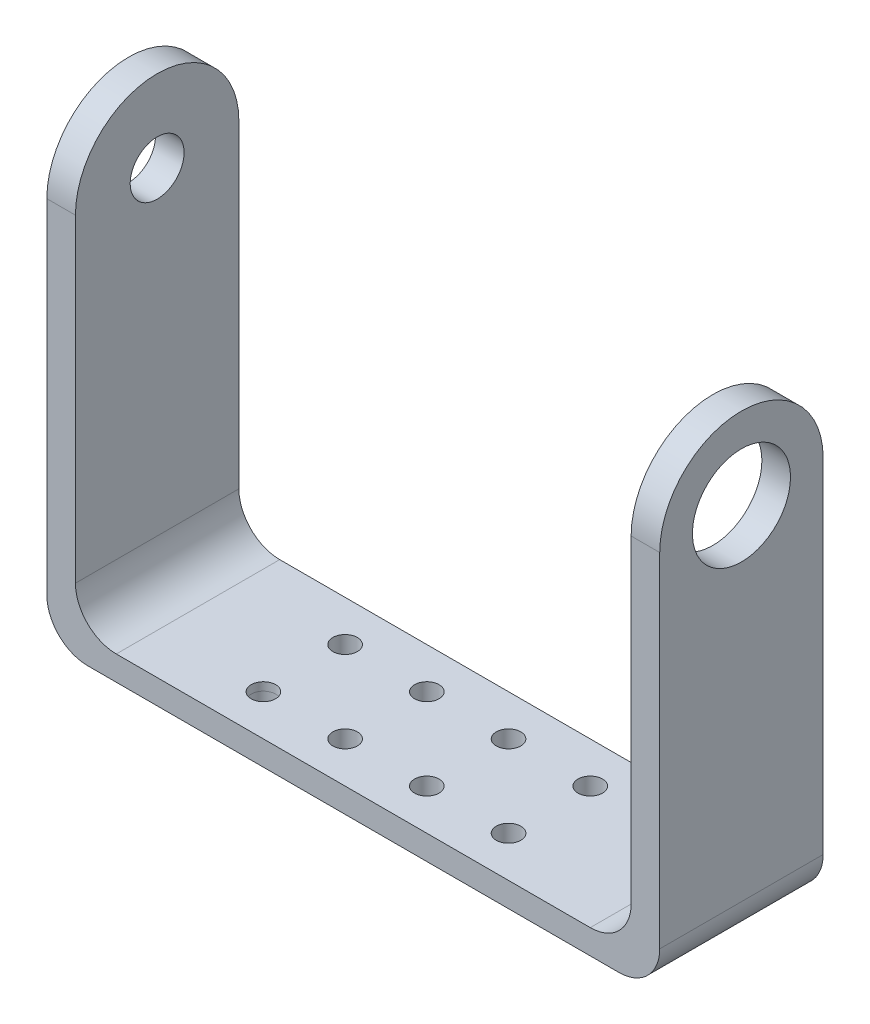
ISO-10303-21;
HEADER;
FILE_DESCRIPTION(('STEP AP214'),'2;1');
FILE_NAME('part.step','',(''),(''),'','','');
FILE_SCHEMA(('AUTOMOTIVE_DESIGN { 1 0 10303 214 1 1 1 1 }'));
ENDSEC;
DATA;
#1=APPLICATION_CONTEXT('core data for automotive mechanical design processes');
#2=APPLICATION_PROTOCOL_DEFINITION('international standard','automotive_design',2000,#1);
#3=PRODUCT_CONTEXT('',#1,'mechanical');
#4=PRODUCT('Part','Part','',(#3));
#5=PRODUCT_RELATED_PRODUCT_CATEGORY('part','',(#4));
#6=PRODUCT_DEFINITION_FORMATION('','',#4);
#7=PRODUCT_DEFINITION_CONTEXT('part definition',#1,'design');
#8=PRODUCT_DEFINITION('design','',#6,#7);
#9=PRODUCT_DEFINITION_SHAPE('','',#8);
#10=(LENGTH_UNIT() NAMED_UNIT(*) SI_UNIT(.MILLI.,.METRE.));
#11=(NAMED_UNIT(*) PLANE_ANGLE_UNIT() SI_UNIT($,.RADIAN.));
#12=(NAMED_UNIT(*) SI_UNIT($,.STERADIAN.) SOLID_ANGLE_UNIT());
#13=UNCERTAINTY_MEASURE_WITH_UNIT(LENGTH_MEASURE(1.E-05),#10,'distance_accuracy_value','');
#14=(GEOMETRIC_REPRESENTATION_CONTEXT(3) GLOBAL_UNCERTAINTY_ASSIGNED_CONTEXT((#13)) GLOBAL_UNIT_ASSIGNED_CONTEXT((#10,
#11,#12)) REPRESENTATION_CONTEXT('',''));
#15=CARTESIAN_POINT('',(0.,0.,0.));
#16=DIRECTION('',(0.,0.,1.));
#17=DIRECTION('',(1.,0.,0.));
#18=AXIS2_PLACEMENT_3D('',#15,#16,#17);
#19=CARTESIAN_POINT('',(30.,8.,-10.));
#20=DIRECTION('',(0.,0.,-1.));
#21=DIRECTION('',(-1.,0.,0.));
#22=AXIS2_PLACEMENT_3D('',#19,#20,#21);
#23=CYLINDRICAL_SURFACE('',#22,5.);
#24=DIRECTION('',(0.,0.,1.));
#25=VECTOR('',#24,1.);
#26=CARTESIAN_POINT('',(35.,8.,-10.));
#27=LINE('',#26,#25);
#28=CARTESIAN_POINT('',(35.,8.,-10.));
#29=VERTEX_POINT('',#28);
#30=CARTESIAN_POINT('',(35.,8.,10.));
#31=VERTEX_POINT('',#30);
#32=EDGE_CURVE('E273',#29,#31,#27,.T.);
#33=ORIENTED_EDGE('',*,*,#32,.F.);
#34=CARTESIAN_POINT('',(30.,8.,-10.));
#35=DIRECTION('',(0.,0.,1.));
#36=DIRECTION('',(1.,0.,0.));
#37=AXIS2_PLACEMENT_3D('',#34,#35,#36);
#38=CIRCLE('',#37,5.);
#39=CARTESIAN_POINT('',(30.,3.,-10.));
#40=VERTEX_POINT('',#39);
#41=EDGE_CURVE('E279',#29,#40,#38,.F.);
#42=ORIENTED_EDGE('',*,*,#41,.T.);
#43=DIRECTION('',(0.,0.,1.));
#44=VECTOR('',#43,1.);
#45=CARTESIAN_POINT('',(30.,3.,-10.));
#46=LINE('',#45,#44);
#47=CARTESIAN_POINT('',(30.,3.,9.99999999999999));
#48=VERTEX_POINT('',#47);
#49=EDGE_CURVE('E276',#48,#40,#46,.F.);
#50=ORIENTED_EDGE('',*,*,#49,.F.);
#51=CARTESIAN_POINT('',(30.,8.,10.));
#52=DIRECTION('',(0.,0.,-1.));
#53=DIRECTION('',(-1.,0.,0.));
#54=AXIS2_PLACEMENT_3D('',#51,#52,#53);
#55=CIRCLE('',#54,5.);
#56=EDGE_CURVE('E281',#48,#31,#55,.F.);
#57=ORIENTED_EDGE('',*,*,#56,.T.);
#58=EDGE_LOOP('',(#33,#42,#50,#57));
#59=FACE_BOUND('',#58,.T.);
#60=ADVANCED_FACE('F77',(#59),#23,.F.);
#61=CARTESIAN_POINT('',(-28.,8.,0.));
#62=DIRECTION('',(0.,0.,-1.));
#63=DIRECTION('',(-1.,0.,0.));
#64=AXIS2_PLACEMENT_3D('',#61,#62,#63);
#65=CYLINDRICAL_SURFACE('',#64,5.);
#66=DIRECTION('',(0.,0.,1.));
#67=VECTOR('',#66,1.);
#68=CARTESIAN_POINT('',(-28.,3.,0.));
#69=LINE('',#68,#67);
#70=CARTESIAN_POINT('',(-28.,3.,-10.));
#71=VERTEX_POINT('',#70);
#72=CARTESIAN_POINT('',(-28.,3.,9.99999999999999));
#73=VERTEX_POINT('',#72);
#74=EDGE_CURVE('E254',#71,#73,#69,.T.);
#75=ORIENTED_EDGE('',*,*,#74,.F.);
#76=CARTESIAN_POINT('',(-28.,8.,-10.));
#77=DIRECTION('',(0.,0.,1.));
#78=DIRECTION('',(1.,0.,0.));
#79=AXIS2_PLACEMENT_3D('',#76,#77,#78);
#80=CIRCLE('',#79,5.);
#81=CARTESIAN_POINT('',(-33.,8.,-10.));
#82=VERTEX_POINT('',#81);
#83=EDGE_CURVE('E269',#71,#82,#80,.F.);
#84=ORIENTED_EDGE('',*,*,#83,.T.);
#85=DIRECTION('',(0.,0.,1.));
#86=VECTOR('',#85,1.);
#87=CARTESIAN_POINT('',(-33.,8.,0.));
#88=LINE('',#87,#86);
#89=CARTESIAN_POINT('',(-33.,8.,10.));
#90=VERTEX_POINT('',#89);
#91=EDGE_CURVE('E266',#90,#82,#88,.F.);
#92=ORIENTED_EDGE('',*,*,#91,.F.);
#93=CARTESIAN_POINT('',(-28.,8.,10.0000000000001));
#94=DIRECTION('',(0.,0.,-1.));
#95=DIRECTION('',(-1.,0.,0.));
#96=AXIS2_PLACEMENT_3D('',#93,#94,#95);
#97=CIRCLE('',#96,5.);
#98=EDGE_CURVE('E271',#90,#73,#97,.F.);
#99=ORIENTED_EDGE('',*,*,#98,.T.);
#100=EDGE_LOOP('',(#75,#84,#92,#99));
#101=FACE_BOUND('',#100,.T.);
#102=ADVANCED_FACE('F320',(#101),#65,.F.);
#103=CARTESIAN_POINT('',(-33.,57.,-10.));
#104=DIRECTION('',(-1.,0.,0.));
#105=DIRECTION('',(0.,0.,1.));
#106=AXIS2_PLACEMENT_3D('',#103,#104,#105);
#107=PLANE('',#106);
#108=CARTESIAN_POINT('',(-33.,47.,0.));
#109=DIRECTION('',(-1.,0.,0.));
#110=DIRECTION('',(0.,0.,1.));
#111=AXIS2_PLACEMENT_3D('',#108,#109,#110);
#112=CIRCLE('',#111,3.3);
#113=CARTESIAN_POINT('',(-33.,47.,3.30000000000005));
#114=VERTEX_POINT('',#113);
#115=EDGE_CURVE('E197',#114,#114,#112,.T.);
#116=ORIENTED_EDGE('',*,*,#115,.T.);
#117=EDGE_LOOP('',(#116));
#118=FACE_BOUND('',#117,.T.);
#119=DIRECTION('',(0.,-1.,0.));
#120=VECTOR('',#119,1.);
#121=CARTESIAN_POINT('',(-33.,57.,10.));
#122=LINE('',#121,#120);
#123=CARTESIAN_POINT('',(-33.,47.,9.99999999999999));
#124=VERTEX_POINT('',#123);
#125=EDGE_CURVE('E224',#124,#90,#122,.T.);
#126=ORIENTED_EDGE('',*,*,#125,.T.);
#127=ORIENTED_EDGE('',*,*,#91,.T.);
#128=DIRECTION('',(0.,-1.,0.));
#129=VECTOR('',#128,1.);
#130=CARTESIAN_POINT('',(-33.,57.,-10.));
#131=LINE('',#130,#129);
#132=CARTESIAN_POINT('',(-33.,47.,-10.));
#133=VERTEX_POINT('',#132);
#134=EDGE_CURVE('E219',#133,#82,#131,.T.);
#135=ORIENTED_EDGE('',*,*,#134,.F.);
#136=CARTESIAN_POINT('',(-33.,47.,0.));
#137=DIRECTION('',(-1.,0.,0.));
#138=DIRECTION('',(0.,0.,1.));
#139=AXIS2_PLACEMENT_3D('',#136,#137,#138);
#140=CIRCLE('',#139,10.);
#141=EDGE_CURVE('E184',#124,#133,#140,.T.);
#142=ORIENTED_EDGE('',*,*,#141,.F.);
#143=EDGE_LOOP('',(#126,#127,#135,#142));
#144=FACE_BOUND('',#143,.T.);
#145=ADVANCED_FACE('F314',(#118,#144),#107,.F.);
#146=CARTESIAN_POINT('',(35.,57.,-10.));
#147=DIRECTION('',(1.,0.,0.));
#148=DIRECTION('',(0.,0.,-1.));
#149=AXIS2_PLACEMENT_3D('',#146,#147,#148);
#150=PLANE('',#149);
#151=CARTESIAN_POINT('',(35.,47.,0.));
#152=DIRECTION('',(1.,0.,0.));
#153=DIRECTION('',(0.,0.,-1.));
#154=AXIS2_PLACEMENT_3D('',#151,#152,#153);
#155=CIRCLE('',#154,6.);
#156=CARTESIAN_POINT('',(35.,47.,-6.00000000000001));
#157=VERTEX_POINT('',#156);
#158=EDGE_CURVE('E203',#157,#157,#155,.T.);
#159=ORIENTED_EDGE('',*,*,#158,.T.);
#160=EDGE_LOOP('',(#159));
#161=FACE_BOUND('',#160,.T.);
#162=DIRECTION('',(0.,-1.,0.));
#163=VECTOR('',#162,1.);
#164=CARTESIAN_POINT('',(35.,57.,-10.));
#165=LINE('',#164,#163);
#166=CARTESIAN_POINT('',(35.,47.,-10.));
#167=VERTEX_POINT('',#166);
#168=EDGE_CURVE('E216',#167,#29,#165,.T.);
#169=ORIENTED_EDGE('',*,*,#168,.T.);
#170=ORIENTED_EDGE('',*,*,#32,.T.);
#171=DIRECTION('',(0.,-1.,0.));
#172=VECTOR('',#171,1.);
#173=CARTESIAN_POINT('',(35.,57.,10.));
#174=LINE('',#173,#172);
#175=CARTESIAN_POINT('',(35.,47.,9.99999999999999));
#176=VERTEX_POINT('',#175);
#177=EDGE_CURVE('E213',#176,#31,#174,.T.);
#178=ORIENTED_EDGE('',*,*,#177,.F.);
#179=CARTESIAN_POINT('',(35.,47.,0.));
#180=DIRECTION('',(1.,0.,0.));
#181=DIRECTION('',(0.,0.,-1.));
#182=AXIS2_PLACEMENT_3D('',#179,#180,#181);
#183=CIRCLE('',#182,10.);
#184=EDGE_CURVE('E185',#167,#176,#183,.T.);
#185=ORIENTED_EDGE('',*,*,#184,.F.);
#186=EDGE_LOOP('',(#169,#170,#178,#185));
#187=FACE_BOUND('',#186,.T.);
#188=ADVANCED_FACE('F456',(#161,#187),#150,.F.);
#189=CARTESIAN_POINT('',(38.5,2.,-10.));
#190=DIRECTION('',(-1.,0.,0.));
#191=DIRECTION('',(0.,0.,1.));
#192=AXIS2_PLACEMENT_3D('',#189,#190,#191);
#193=PLANE('',#192);
#194=CARTESIAN_POINT('',(38.5,47.,0.));
#195=DIRECTION('',(1.,0.,0.));
#196=DIRECTION('',(0.,0.,-1.));
#197=AXIS2_PLACEMENT_3D('',#194,#195,#196);
#198=CIRCLE('',#197,6.);
#199=CARTESIAN_POINT('',(38.5,47.,-6.00000000000001));
#200=VERTEX_POINT('',#199);
#201=EDGE_CURVE('E200',#200,#200,#198,.T.);
#202=ORIENTED_EDGE('',*,*,#201,.F.);
#203=EDGE_LOOP('',(#202));
#204=FACE_BOUND('',#203,.T.);
#205=DIRECTION('',(0.,-1.,0.));
#206=VECTOR('',#205,1.);
#207=CARTESIAN_POINT('',(38.5,2.,9.99999999999999));
#208=LINE('',#207,#206);
#209=CARTESIAN_POINT('',(38.5,47.,9.99999999999999));
#210=VERTEX_POINT('',#209);
#211=CARTESIAN_POINT('',(38.5,5.,9.99999999999999));
#212=VERTEX_POINT('',#211);
#213=EDGE_CURVE('E251',#210,#212,#208,.T.);
#214=ORIENTED_EDGE('',*,*,#213,.T.);
#215=DIRECTION('',(0.,0.,-1.));
#216=VECTOR('',#215,1.);
#217=CARTESIAN_POINT('',(38.5,5.,-10.));
#218=LINE('',#217,#216);
#219=CARTESIAN_POINT('',(38.5,5.,-10.));
#220=VERTEX_POINT('',#219);
#221=EDGE_CURVE('E283',#212,#220,#218,.T.);
#222=ORIENTED_EDGE('',*,*,#221,.T.);
#223=DIRECTION('',(0.,-1.,0.));
#224=VECTOR('',#223,1.);
#225=CARTESIAN_POINT('',(38.5,2.,-10.));
#226=LINE('',#225,#224);
#227=CARTESIAN_POINT('',(38.5,47.,-10.));
#228=VERTEX_POINT('',#227);
#229=EDGE_CURVE('E249',#228,#220,#226,.T.);
#230=ORIENTED_EDGE('',*,*,#229,.F.);
#231=CARTESIAN_POINT('',(38.5,47.,0.));
#232=DIRECTION('',(1.,0.,0.));
#233=DIRECTION('',(0.,0.,-1.));
#234=AXIS2_PLACEMENT_3D('',#231,#232,#233);
#235=CIRCLE('',#234,10.);
#236=EDGE_CURVE('E208',#228,#210,#235,.T.);
#237=ORIENTED_EDGE('',*,*,#236,.T.);
#238=EDGE_LOOP('',(#214,#222,#230,#237));
#239=FACE_BOUND('',#238,.T.);
#240=ADVANCED_FACE('F302',(#204,#239),#193,.F.);
#241=CARTESIAN_POINT('',(35.,2.,10.));
#242=DIRECTION('',(0.,0.,-1.));
#243=DIRECTION('',(-1.,0.,0.));
#244=AXIS2_PLACEMENT_3D('',#241,#242,#243);
#245=PLANE('',#244);
#246=DIRECTION('',(1.,0.,0.));
#247=VECTOR('',#246,1.);
#248=CARTESIAN_POINT('',(35.,0.,10.));
#249=LINE('',#248,#247);
#250=CARTESIAN_POINT('',(-31.5,0.,10.0000000000001));
#251=VERTEX_POINT('',#250);
#252=CARTESIAN_POINT('',(33.5,0.,10.));
#253=VERTEX_POINT('',#252);
#254=EDGE_CURVE('E245',#251,#253,#249,.T.);
#255=ORIENTED_EDGE('',*,*,#254,.T.);
#256=CARTESIAN_POINT('',(33.5,5.,10.));
#257=DIRECTION('',(0.,0.,-1.));
#258=DIRECTION('',(-1.,0.,0.));
#259=AXIS2_PLACEMENT_3D('',#256,#257,#258);
#260=CIRCLE('',#259,5.);
#261=EDGE_CURVE('E85',#253,#212,#260,.F.);
#262=ORIENTED_EDGE('',*,*,#261,.T.);
#263=ORIENTED_EDGE('',*,*,#213,.F.);
#264=DIRECTION('',(1.,0.,0.));
#265=VECTOR('',#264,1.);
#266=CARTESIAN_POINT('',(-48.5,47.,9.99999999999999));
#267=LINE('',#266,#265);
#268=EDGE_CURVE('E204',#176,#210,#267,.T.);
#269=ORIENTED_EDGE('',*,*,#268,.F.);
#270=ORIENTED_EDGE('',*,*,#177,.T.);
#271=ORIENTED_EDGE('',*,*,#56,.F.);
#272=DIRECTION('',(1.,0.,0.));
#273=VECTOR('',#272,1.);
#274=CARTESIAN_POINT('',(-33.,3.,9.99999999999999));
#275=LINE('',#274,#273);
#276=EDGE_CURVE('E325',#73,#48,#275,.T.);
#277=ORIENTED_EDGE('',*,*,#276,.F.);
#278=ORIENTED_EDGE('',*,*,#98,.F.);
#279=ORIENTED_EDGE('',*,*,#125,.F.);
#280=CARTESIAN_POINT('',(-36.5,47.,9.99999999999999));
#281=VERTEX_POINT('',#280);
#282=EDGE_CURVE('E207',#281,#124,#267,.T.);
#283=ORIENTED_EDGE('',*,*,#282,.F.);
#284=DIRECTION('',(0.,-1.,0.));
#285=VECTOR('',#284,1.);
#286=CARTESIAN_POINT('',(-36.5,0.,10.));
#287=LINE('',#286,#285);
#288=CARTESIAN_POINT('',(-36.5,5.,10.));
#289=VERTEX_POINT('',#288);
#290=EDGE_CURVE('E177',#281,#289,#287,.T.);
#291=ORIENTED_EDGE('',*,*,#290,.T.);
#292=CARTESIAN_POINT('',(-31.5,5.,10.0000000000001));
#293=DIRECTION('',(0.,0.,-1.));
#294=DIRECTION('',(-1.,0.,0.));
#295=AXIS2_PLACEMENT_3D('',#292,#293,#294);
#296=CIRCLE('',#295,5.);
#297=EDGE_CURVE('E293',#289,#251,#296,.F.);
#298=ORIENTED_EDGE('',*,*,#297,.T.);
#299=EDGE_LOOP('',(#255,#262,#263,#269,#270,#271,#277,#278,#279,#283,#291,#298));
#300=FACE_BOUND('',#299,.T.);
#301=ADVANCED_FACE('F297',(#300),#245,.F.);
#302=CARTESIAN_POINT('',(0.,0.,0.));
#303=DIRECTION('',(0.,1.,0.));
#304=DIRECTION('',(0.,0.,1.));
#305=AXIS2_PLACEMENT_3D('',#302,#303,#304);
#306=PLANE('',#305);
#307=DIRECTION('',(-1.,0.,0.));
#308=VECTOR('',#307,1.);
#309=CARTESIAN_POINT('',(35.,0.,-10.));
#310=LINE('',#309,#308);
#311=CARTESIAN_POINT('',(33.5,0.,-10.));
#312=VERTEX_POINT('',#311);
#313=CARTESIAN_POINT('',(-31.5,0.,-10.));
#314=VERTEX_POINT('',#313);
#315=EDGE_CURVE('E247',#312,#314,#310,.T.);
#316=ORIENTED_EDGE('',*,*,#315,.F.);
#317=DIRECTION('',(0.,0.,-1.));
#318=VECTOR('',#317,1.);
#319=CARTESIAN_POINT('',(33.5,0.,0.));
#320=LINE('',#319,#318);
#321=EDGE_CURVE('E98',#312,#253,#320,.F.);
#322=ORIENTED_EDGE('',*,*,#321,.T.);
#323=ORIENTED_EDGE('',*,*,#254,.F.);
#324=DIRECTION('',(0.,0.,-1.));
#325=VECTOR('',#324,1.);
#326=CARTESIAN_POINT('',(-31.5,0.,-10.));
#327=LINE('',#326,#325);
#328=EDGE_CURVE('E289',#251,#314,#327,.T.);
#329=ORIENTED_EDGE('',*,*,#328,.T.);
#330=EDGE_LOOP('',(#316,#322,#323,#329));
#331=FACE_BOUND('',#330,.T.);
#332=CARTESIAN_POINT('',(-15.,0.,-5.));
#333=DIRECTION('',(0.,1.,0.));
#334=DIRECTION('',(0.,0.,1.));
#335=AXIS2_PLACEMENT_3D('',#332,#333,#334);
#336=CIRCLE('',#335,1.5);
#337=CARTESIAN_POINT('',(-15.,0.,-3.5));
#338=VERTEX_POINT('',#337);
#339=EDGE_CURVE('E242',#338,#338,#336,.T.);
#340=ORIENTED_EDGE('',*,*,#339,.T.);
#341=EDGE_LOOP('',(#340));
#342=FACE_BOUND('',#341,.T.);
#343=CARTESIAN_POINT('',(-5.,0.,-5.));
#344=DIRECTION('',(0.,1.,0.));
#345=DIRECTION('',(0.,0.,1.));
#346=AXIS2_PLACEMENT_3D('',#343,#344,#345);
#347=CIRCLE('',#346,1.5);
#348=CARTESIAN_POINT('',(-5.,0.,-3.5));
#349=VERTEX_POINT('',#348);
#350=EDGE_CURVE('E239',#349,#349,#347,.T.);
#351=ORIENTED_EDGE('',*,*,#350,.T.);
#352=EDGE_LOOP('',(#351));
#353=FACE_BOUND('',#352,.T.);
#354=CARTESIAN_POINT('',(-15.,0.,5.));
#355=DIRECTION('',(0.,1.,0.));
#356=DIRECTION('',(0.,0.,1.));
#357=AXIS2_PLACEMENT_3D('',#354,#355,#356);
#358=CIRCLE('',#357,1.5);
#359=CARTESIAN_POINT('',(-15.,0.,6.5));
#360=VERTEX_POINT('',#359);
#361=EDGE_CURVE('E236',#360,#360,#358,.T.);
#362=ORIENTED_EDGE('',*,*,#361,.T.);
#363=EDGE_LOOP('',(#362));
#364=FACE_BOUND('',#363,.T.);
#365=CARTESIAN_POINT('',(-5.,0.,5.));
#366=DIRECTION('',(0.,1.,0.));
#367=DIRECTION('',(0.,0.,1.));
#368=AXIS2_PLACEMENT_3D('',#365,#366,#367);
#369=CIRCLE('',#368,1.5);
#370=CARTESIAN_POINT('',(-5.,0.,6.5));
#371=VERTEX_POINT('',#370);
#372=EDGE_CURVE('E233',#371,#371,#369,.T.);
#373=ORIENTED_EDGE('',*,*,#372,.T.);
#374=EDGE_LOOP('',(#373));
#375=FACE_BOUND('',#374,.T.);
#376=CARTESIAN_POINT('',(15.,0.,5.));
#377=DIRECTION('',(0.,1.,0.));
#378=DIRECTION('',(0.,0.,-1.));
#379=AXIS2_PLACEMENT_3D('',#376,#377,#378);
#380=CIRCLE('',#379,1.5);
#381=CARTESIAN_POINT('',(15.,0.,3.5));
#382=VERTEX_POINT('',#381);
#383=EDGE_CURVE('E230',#382,#382,#380,.T.);
#384=ORIENTED_EDGE('',*,*,#383,.T.);
#385=EDGE_LOOP('',(#384));
#386=FACE_BOUND('',#385,.T.);
#387=CARTESIAN_POINT('',(5.,0.,5.));
#388=DIRECTION('',(0.,1.,0.));
#389=DIRECTION('',(0.,0.,-1.));
#390=AXIS2_PLACEMENT_3D('',#387,#388,#389);
#391=CIRCLE('',#390,1.5);
#392=CARTESIAN_POINT('',(5.,0.,3.5));
#393=VERTEX_POINT('',#392);
#394=EDGE_CURVE('E227',#393,#393,#391,.T.);
#395=ORIENTED_EDGE('',*,*,#394,.T.);
#396=EDGE_LOOP('',(#395));
#397=FACE_BOUND('',#396,.T.);
#398=CARTESIAN_POINT('',(5.,0.,-5.));
#399=DIRECTION('',(0.,1.,0.));
#400=DIRECTION('',(0.,0.,-1.));
#401=AXIS2_PLACEMENT_3D('',#398,#399,#400);
#402=CIRCLE('',#401,1.5);
#403=CARTESIAN_POINT('',(5.,0.,-6.5));
#404=VERTEX_POINT('',#403);
#405=EDGE_CURVE('E223',#404,#404,#402,.T.);
#406=ORIENTED_EDGE('',*,*,#405,.T.);
#407=EDGE_LOOP('',(#406));
#408=FACE_BOUND('',#407,.T.);
#409=CARTESIAN_POINT('',(15.,0.,-5.));
#410=DIRECTION('',(0.,1.,0.));
#411=DIRECTION('',(0.,0.,-1.));
#412=AXIS2_PLACEMENT_3D('',#409,#410,#411);
#413=CIRCLE('',#412,1.5);
#414=CARTESIAN_POINT('',(15.,0.,-6.5));
#415=VERTEX_POINT('',#414);
#416=EDGE_CURVE('E220',#415,#415,#413,.T.);
#417=ORIENTED_EDGE('',*,*,#416,.T.);
#418=EDGE_LOOP('',(#417));
#419=FACE_BOUND('',#418,.T.);
#420=ADVANCED_FACE('F305',(#331,#342,#353,#364,#375,#386,#397,#408,#419),#306,.F.);
#421=CARTESIAN_POINT('',(35.,2.,-10.));
#422=DIRECTION('',(0.,0.,1.));
#423=DIRECTION('',(1.,0.,0.));
#424=AXIS2_PLACEMENT_3D('',#421,#422,#423);
#425=PLANE('',#424);
#426=ORIENTED_EDGE('',*,*,#229,.T.);
#427=CARTESIAN_POINT('',(33.5,5.,-10.));
#428=DIRECTION('',(0.,0.,1.));
#429=DIRECTION('',(1.,0.,0.));
#430=AXIS2_PLACEMENT_3D('',#427,#428,#429);
#431=CIRCLE('',#430,5.);
#432=EDGE_CURVE('E287',#220,#312,#431,.F.);
#433=ORIENTED_EDGE('',*,*,#432,.T.);
#434=ORIENTED_EDGE('',*,*,#315,.T.);
#435=CARTESIAN_POINT('',(-31.5,5.,-10.));
#436=DIRECTION('',(0.,0.,1.));
#437=DIRECTION('',(1.,0.,0.));
#438=AXIS2_PLACEMENT_3D('',#435,#436,#437);
#439=CIRCLE('',#438,5.);
#440=CARTESIAN_POINT('',(-36.5,5.,-10.));
#441=VERTEX_POINT('',#440);
#442=EDGE_CURVE('E175',#314,#441,#439,.F.);
#443=ORIENTED_EDGE('',*,*,#442,.T.);
#444=DIRECTION('',(0.,1.,0.));
#445=VECTOR('',#444,1.);
#446=CARTESIAN_POINT('',(-36.5,0.,-10.));
#447=LINE('',#446,#445);
#448=CARTESIAN_POINT('',(-36.5,47.,-10.));
#449=VERTEX_POINT('',#448);
#450=EDGE_CURVE('E167',#441,#449,#447,.T.);
#451=ORIENTED_EDGE('',*,*,#450,.T.);
#452=DIRECTION('',(1.,0.,0.));
#453=VECTOR('',#452,1.);
#454=CARTESIAN_POINT('',(-48.5,47.,-10.));
#455=LINE('',#454,#453);
#456=EDGE_CURVE('E172',#449,#133,#455,.T.);
#457=ORIENTED_EDGE('',*,*,#456,.T.);
#458=ORIENTED_EDGE('',*,*,#134,.T.);
#459=ORIENTED_EDGE('',*,*,#83,.F.);
#460=DIRECTION('',(-1.,0.,0.));
#461=VECTOR('',#460,1.);
#462=CARTESIAN_POINT('',(-33.,3.,-10.));
#463=LINE('',#462,#461);
#464=EDGE_CURVE('E318',#40,#71,#463,.T.);
#465=ORIENTED_EDGE('',*,*,#464,.F.);
#466=ORIENTED_EDGE('',*,*,#41,.F.);
#467=ORIENTED_EDGE('',*,*,#168,.F.);
#468=EDGE_CURVE('E186',#167,#228,#455,.T.);
#469=ORIENTED_EDGE('',*,*,#468,.T.);
#470=EDGE_LOOP('',(#426,#433,#434,#443,#451,#457,#458,#459,#465,#466,#467,#469));
#471=FACE_BOUND('',#470,.T.);
#472=ADVANCED_FACE('F170',(#471),#425,.F.);
#473=CARTESIAN_POINT('',(-15.,2.,-5.));
#474=DIRECTION('',(0.,-1.,0.));
#475=DIRECTION('',(0.,0.,-1.));
#476=AXIS2_PLACEMENT_3D('',#473,#474,#475);
#477=CYLINDRICAL_SURFACE('',#476,1.5);
#478=ORIENTED_EDGE('',*,*,#339,.F.);
#479=EDGE_LOOP('',(#478));
#480=FACE_BOUND('',#479,.T.);
#481=CARTESIAN_POINT('',(-15.,3.,-5.));
#482=DIRECTION('',(0.,1.,0.));
#483=DIRECTION('',(0.,0.,1.));
#484=AXIS2_PLACEMENT_3D('',#481,#482,#483);
#485=CIRCLE('',#484,1.5);
#486=CARTESIAN_POINT('',(-15.,3.,-3.5));
#487=VERTEX_POINT('',#486);
#488=EDGE_CURVE('E327',#487,#487,#485,.T.);
#489=ORIENTED_EDGE('',*,*,#488,.T.);
#490=EDGE_LOOP('',(#489));
#491=FACE_BOUND('',#490,.T.);
#492=ADVANCED_FACE('F496',(#480,#491),#477,.F.);
#493=CARTESIAN_POINT('',(-5.,2.,-5.));
#494=DIRECTION('',(0.,-1.,0.));
#495=DIRECTION('',(0.,0.,-1.));
#496=AXIS2_PLACEMENT_3D('',#493,#494,#495);
#497=CYLINDRICAL_SURFACE('',#496,1.5);
#498=ORIENTED_EDGE('',*,*,#350,.F.);
#499=EDGE_LOOP('',(#498));
#500=FACE_BOUND('',#499,.T.);
#501=CARTESIAN_POINT('',(-5.,3.,-5.));
#502=DIRECTION('',(0.,1.,0.));
#503=DIRECTION('',(0.,0.,1.));
#504=AXIS2_PLACEMENT_3D('',#501,#502,#503);
#505=CIRCLE('',#504,1.5);
#506=CARTESIAN_POINT('',(-5.,3.,-3.5));
#507=VERTEX_POINT('',#506);
#508=EDGE_CURVE('E331',#507,#507,#505,.T.);
#509=ORIENTED_EDGE('',*,*,#508,.T.);
#510=EDGE_LOOP('',(#509));
#511=FACE_BOUND('',#510,.T.);
#512=ADVANCED_FACE('F344',(#500,#511),#497,.F.);
#513=CARTESIAN_POINT('',(-15.,2.,5.));
#514=DIRECTION('',(0.,-1.,0.));
#515=DIRECTION('',(0.,0.,-1.));
#516=AXIS2_PLACEMENT_3D('',#513,#514,#515);
#517=CYLINDRICAL_SURFACE('',#516,1.5);
#518=CARTESIAN_POINT('',(-15.,2.,5.));
#519=DIRECTION('',(0.,-1.,0.));
#520=DIRECTION('',(0.,0.,-1.));
#521=AXIS2_PLACEMENT_3D('',#518,#519,#520);
#522=CIRCLE('',#521,1.5);
#523=CARTESIAN_POINT('',(-15.,2.,3.50000000000001));
#524=VERTEX_POINT('',#523);
#525=EDGE_CURVE('E192',#524,#524,#522,.T.);
#526=ORIENTED_EDGE('',*,*,#525,.F.);
#527=EDGE_LOOP('',(#526));
#528=FACE_BOUND('',#527,.T.);
#529=ORIENTED_EDGE('',*,*,#361,.F.);
#530=EDGE_LOOP('',(#529));
#531=FACE_BOUND('',#530,.T.);
#532=ADVANCED_FACE('F340',(#528,#531),#517,.F.);
#533=CARTESIAN_POINT('',(-5.,2.,5.));
#534=DIRECTION('',(0.,-1.,0.));
#535=DIRECTION('',(0.,0.,-1.));
#536=AXIS2_PLACEMENT_3D('',#533,#534,#535);
#537=CYLINDRICAL_SURFACE('',#536,1.5);
#538=ORIENTED_EDGE('',*,*,#372,.F.);
#539=EDGE_LOOP('',(#538));
#540=FACE_BOUND('',#539,.T.);
#541=CARTESIAN_POINT('',(-5.,3.,5.));
#542=DIRECTION('',(0.,1.,0.));
#543=DIRECTION('',(0.,0.,1.));
#544=AXIS2_PLACEMENT_3D('',#541,#542,#543);
#545=CIRCLE('',#544,1.5);
#546=CARTESIAN_POINT('',(-5.,3.,6.5));
#547=VERTEX_POINT('',#546);
#548=EDGE_CURVE('E397',#547,#547,#545,.T.);
#549=ORIENTED_EDGE('',*,*,#548,.T.);
#550=EDGE_LOOP('',(#549));
#551=FACE_BOUND('',#550,.T.);
#552=ADVANCED_FACE('F343',(#540,#551),#537,.F.);
#553=CARTESIAN_POINT('',(15.,2.,5.));
#554=DIRECTION('',(0.,-1.,0.));
#555=DIRECTION('',(0.,0.,-1.));
#556=AXIS2_PLACEMENT_3D('',#553,#554,#555);
#557=CYLINDRICAL_SURFACE('',#556,1.5);
#558=ORIENTED_EDGE('',*,*,#383,.F.);
#559=EDGE_LOOP('',(#558));
#560=FACE_BOUND('',#559,.T.);
#561=CARTESIAN_POINT('',(15.,3.,5.));
#562=DIRECTION('',(0.,1.,0.));
#563=DIRECTION('',(0.,0.,1.));
#564=AXIS2_PLACEMENT_3D('',#561,#562,#563);
#565=CIRCLE('',#564,1.5);
#566=CARTESIAN_POINT('',(15.,3.,6.5));
#567=VERTEX_POINT('',#566);
#568=EDGE_CURVE('E372',#567,#567,#565,.T.);
#569=ORIENTED_EDGE('',*,*,#568,.T.);
#570=EDGE_LOOP('',(#569));
#571=FACE_BOUND('',#570,.T.);
#572=ADVANCED_FACE('F410',(#560,#571),#557,.F.);
#573=CARTESIAN_POINT('',(5.,2.,5.));
#574=DIRECTION('',(0.,-1.,0.));
#575=DIRECTION('',(0.,0.,-1.));
#576=AXIS2_PLACEMENT_3D('',#573,#574,#575);
#577=CYLINDRICAL_SURFACE('',#576,1.5);
#578=ORIENTED_EDGE('',*,*,#394,.F.);
#579=EDGE_LOOP('',(#578));
#580=FACE_BOUND('',#579,.T.);
#581=CARTESIAN_POINT('',(5.,3.,5.));
#582=DIRECTION('',(0.,1.,0.));
#583=DIRECTION('',(0.,0.,1.));
#584=AXIS2_PLACEMENT_3D('',#581,#582,#583);
#585=CIRCLE('',#584,1.5);
#586=CARTESIAN_POINT('',(5.,3.,6.5));
#587=VERTEX_POINT('',#586);
#588=EDGE_CURVE('E377',#587,#587,#585,.T.);
#589=ORIENTED_EDGE('',*,*,#588,.T.);
#590=EDGE_LOOP('',(#589));
#591=FACE_BOUND('',#590,.T.);
#592=ADVANCED_FACE('F408',(#580,#591),#577,.F.);
#593=CARTESIAN_POINT('',(5.,2.,-5.));
#594=DIRECTION('',(0.,-1.,0.));
#595=DIRECTION('',(0.,0.,-1.));
#596=AXIS2_PLACEMENT_3D('',#593,#594,#595);
#597=CYLINDRICAL_SURFACE('',#596,1.5);
#598=ORIENTED_EDGE('',*,*,#405,.F.);
#599=EDGE_LOOP('',(#598));
#600=FACE_BOUND('',#599,.T.);
#601=CARTESIAN_POINT('',(5.,3.,-5.));
#602=DIRECTION('',(0.,1.,0.));
#603=DIRECTION('',(0.,0.,1.));
#604=AXIS2_PLACEMENT_3D('',#601,#602,#603);
#605=CIRCLE('',#604,1.5);
#606=CARTESIAN_POINT('',(5.,3.,-3.5));
#607=VERTEX_POINT('',#606);
#608=EDGE_CURVE('E371',#607,#607,#605,.T.);
#609=ORIENTED_EDGE('',*,*,#608,.T.);
#610=EDGE_LOOP('',(#609));
#611=FACE_BOUND('',#610,.T.);
#612=ADVANCED_FACE('F365',(#600,#611),#597,.F.);
#613=CARTESIAN_POINT('',(15.,2.,-5.));
#614=DIRECTION('',(0.,-1.,0.));
#615=DIRECTION('',(0.,0.,-1.));
#616=AXIS2_PLACEMENT_3D('',#613,#614,#615);
#617=CYLINDRICAL_SURFACE('',#616,1.5);
#618=ORIENTED_EDGE('',*,*,#416,.F.);
#619=EDGE_LOOP('',(#618));
#620=FACE_BOUND('',#619,.T.);
#621=CARTESIAN_POINT('',(15.,3.,-5.));
#622=DIRECTION('',(0.,1.,0.));
#623=DIRECTION('',(0.,0.,1.));
#624=AXIS2_PLACEMENT_3D('',#621,#622,#623);
#625=CIRCLE('',#624,1.5);
#626=CARTESIAN_POINT('',(15.,3.,-3.5));
#627=VERTEX_POINT('',#626);
#628=EDGE_CURVE('E369',#627,#627,#625,.T.);
#629=ORIENTED_EDGE('',*,*,#628,.T.);
#630=EDGE_LOOP('',(#629));
#631=FACE_BOUND('',#630,.T.);
#632=ADVANCED_FACE('F361',(#620,#631),#617,.F.);
#633=CARTESIAN_POINT('',(-48.5,47.,0.));
#634=DIRECTION('',(1.,0.,0.));
#635=DIRECTION('',(0.,0.,-1.));
#636=AXIS2_PLACEMENT_3D('',#633,#634,#635);
#637=CYLINDRICAL_SURFACE('',#636,10.);
#638=ORIENTED_EDGE('',*,*,#184,.T.);
#639=ORIENTED_EDGE('',*,*,#268,.T.);
#640=ORIENTED_EDGE('',*,*,#236,.F.);
#641=ORIENTED_EDGE('',*,*,#468,.F.);
#642=EDGE_LOOP('',(#638,#639,#640,#641));
#643=FACE_BOUND('',#642,.T.);
#644=ADVANCED_FACE('F364',(#643),#637,.T.);
#645=ORIENTED_EDGE('',*,*,#456,.F.);
#646=CARTESIAN_POINT('',(-36.5,47.,0.));
#647=DIRECTION('',(-1.,0.,0.));
#648=DIRECTION('',(0.,0.,1.));
#649=AXIS2_PLACEMENT_3D('',#646,#647,#648);
#650=CIRCLE('',#649,10.);
#651=EDGE_CURVE('E178',#449,#281,#650,.F.);
#652=ORIENTED_EDGE('',*,*,#651,.T.);
#653=ORIENTED_EDGE('',*,*,#282,.T.);
#654=ORIENTED_EDGE('',*,*,#141,.T.);
#655=EDGE_LOOP('',(#645,#652,#653,#654));
#656=FACE_BOUND('',#655,.T.);
#657=ADVANCED_FACE('F182',(#656),#637,.T.);
#658=CARTESIAN_POINT('',(-48.5,47.,0.));
#659=DIRECTION('',(1.,0.,0.));
#660=DIRECTION('',(0.,0.,-1.));
#661=AXIS2_PLACEMENT_3D('',#658,#659,#660);
#662=CYLINDRICAL_SURFACE('',#661,6.);
#663=ORIENTED_EDGE('',*,*,#201,.T.);
#664=EDGE_LOOP('',(#663));
#665=FACE_BOUND('',#664,.T.);
#666=ORIENTED_EDGE('',*,*,#158,.F.);
#667=EDGE_LOOP('',(#666));
#668=FACE_BOUND('',#667,.T.);
#669=ADVANCED_FACE('F449',(#665,#668),#662,.F.);
#670=CARTESIAN_POINT('',(-33.,47.,0.));
#671=DIRECTION('',(-1.,0.,0.));
#672=DIRECTION('',(0.,0.,1.));
#673=AXIS2_PLACEMENT_3D('',#670,#671,#672);
#674=CYLINDRICAL_SURFACE('',#673,3.3);
#675=ORIENTED_EDGE('',*,*,#115,.F.);
#676=EDGE_LOOP('',(#675));
#677=FACE_BOUND('',#676,.T.);
#678=CARTESIAN_POINT('',(-36.5,47.,0.));
#679=DIRECTION('',(-1.,0.,0.));
#680=DIRECTION('',(0.,0.,1.));
#681=AXIS2_PLACEMENT_3D('',#678,#679,#680);
#682=CIRCLE('',#681,3.3);
#683=CARTESIAN_POINT('',(-36.5,47.,3.30000000000005));
#684=VERTEX_POINT('',#683);
#685=EDGE_CURVE('E189',#684,#684,#682,.T.);
#686=ORIENTED_EDGE('',*,*,#685,.T.);
#687=EDGE_LOOP('',(#686));
#688=FACE_BOUND('',#687,.T.);
#689=ADVANCED_FACE('F445',(#677,#688),#674,.F.);
#690=CARTESIAN_POINT('',(-36.5,0.,0.));
#691=DIRECTION('',(-1.,0.,0.));
#692=DIRECTION('',(0.,0.,1.));
#693=AXIS2_PLACEMENT_3D('',#690,#691,#692);
#694=PLANE('',#693);
#695=ORIENTED_EDGE('',*,*,#685,.F.);
#696=EDGE_LOOP('',(#695));
#697=FACE_BOUND('',#696,.T.);
#698=ORIENTED_EDGE('',*,*,#450,.F.);
#699=DIRECTION('',(0.,0.,-1.));
#700=VECTOR('',#699,1.);
#701=CARTESIAN_POINT('',(-36.5,5.,10.));
#702=LINE('',#701,#700);
#703=EDGE_CURVE('E12',#441,#289,#702,.F.);
#704=ORIENTED_EDGE('',*,*,#703,.T.);
#705=ORIENTED_EDGE('',*,*,#290,.F.);
#706=ORIENTED_EDGE('',*,*,#651,.F.);
#707=EDGE_LOOP('',(#698,#704,#705,#706));
#708=FACE_BOUND('',#707,.T.);
#709=ADVANCED_FACE('F188',(#697,#708),#694,.T.);
#710=CARTESIAN_POINT('',(0.,3.,0.));
#711=DIRECTION('',(0.,-1.,0.));
#712=DIRECTION('',(0.,0.,-1.));
#713=AXIS2_PLACEMENT_3D('',#710,#711,#712);
#714=PLANE('',#713);
#715=ORIENTED_EDGE('',*,*,#276,.T.);
#716=ORIENTED_EDGE('',*,*,#49,.T.);
#717=ORIENTED_EDGE('',*,*,#464,.T.);
#718=ORIENTED_EDGE('',*,*,#74,.T.);
#719=EDGE_LOOP('',(#715,#716,#717,#718));
#720=FACE_BOUND('',#719,.T.);
#721=ORIENTED_EDGE('',*,*,#488,.F.);
#722=EDGE_LOOP('',(#721));
#723=FACE_BOUND('',#722,.T.);
#724=ORIENTED_EDGE('',*,*,#508,.F.);
#725=EDGE_LOOP('',(#724));
#726=FACE_BOUND('',#725,.T.);
#727=ORIENTED_EDGE('',*,*,#608,.F.);
#728=EDGE_LOOP('',(#727));
#729=FACE_BOUND('',#728,.T.);
#730=ORIENTED_EDGE('',*,*,#628,.F.);
#731=EDGE_LOOP('',(#730));
#732=FACE_BOUND('',#731,.T.);
#733=ORIENTED_EDGE('',*,*,#568,.F.);
#734=EDGE_LOOP('',(#733));
#735=FACE_BOUND('',#734,.T.);
#736=ORIENTED_EDGE('',*,*,#588,.F.);
#737=EDGE_LOOP('',(#736));
#738=FACE_BOUND('',#737,.T.);
#739=ORIENTED_EDGE('',*,*,#548,.F.);
#740=EDGE_LOOP('',(#739));
#741=FACE_BOUND('',#740,.T.);
#742=CARTESIAN_POINT('',(-15.,3.,5.));
#743=DIRECTION('',(0.,1.,0.));
#744=DIRECTION('',(0.,0.,1.));
#745=AXIS2_PLACEMENT_3D('',#742,#743,#744);
#746=CIRCLE('',#745,1.49887169518485);
#747=CARTESIAN_POINT('',(-15.,3.,6.49887169518485));
#748=VERTEX_POINT('',#747);
#749=EDGE_CURVE('E400',#748,#748,#746,.T.);
#750=ORIENTED_EDGE('',*,*,#749,.F.);
#751=EDGE_LOOP('',(#750));
#752=FACE_BOUND('',#751,.T.);
#753=ADVANCED_FACE('F323',(#720,#723,#726,#729,#732,#735,#738,#741,#752),#714,.F.);
#754=CARTESIAN_POINT('',(0.,2.,0.));
#755=DIRECTION('',(0.,-1.,0.));
#756=DIRECTION('',(0.,0.,-1.));
#757=AXIS2_PLACEMENT_3D('',#754,#755,#756);
#758=PLANE('',#757);
#759=ORIENTED_EDGE('',*,*,#525,.T.);
#760=EDGE_LOOP('',(#759));
#761=FACE_BOUND('',#760,.T.);
#762=CARTESIAN_POINT('',(-15.,2.,5.));
#763=DIRECTION('',(0.,1.,0.));
#764=DIRECTION('',(0.,0.,1.));
#765=AXIS2_PLACEMENT_3D('',#762,#763,#764);
#766=CIRCLE('',#765,1.49887169518485);
#767=CARTESIAN_POINT('',(-15.,2.,6.49887169518485));
#768=VERTEX_POINT('',#767);
#769=EDGE_CURVE('E402',#768,#768,#766,.T.);
#770=ORIENTED_EDGE('',*,*,#769,.T.);
#771=EDGE_LOOP('',(#770));
#772=FACE_BOUND('',#771,.T.);
#773=ADVANCED_FACE('F337',(#761,#772),#758,.T.);
#774=CARTESIAN_POINT('',(-15.,3.,5.));
#775=DIRECTION('',(0.,-1.,0.));
#776=DIRECTION('',(0.,0.,-1.));
#777=AXIS2_PLACEMENT_3D('',#774,#775,#776);
#778=CYLINDRICAL_SURFACE('',#777,1.49887169518485);
#779=ORIENTED_EDGE('',*,*,#749,.T.);
#780=EDGE_LOOP('',(#779));
#781=FACE_BOUND('',#780,.T.);
#782=ORIENTED_EDGE('',*,*,#769,.F.);
#783=EDGE_LOOP('',(#782));
#784=FACE_BOUND('',#783,.T.);
#785=ADVANCED_FACE('F431',(#781,#784),#778,.F.);
#786=CARTESIAN_POINT('',(33.5,5.,-10.));
#787=DIRECTION('',(0.,0.,-1.));
#788=DIRECTION('',(-1.,0.,0.));
#789=AXIS2_PLACEMENT_3D('',#786,#787,#788);
#790=CYLINDRICAL_SURFACE('',#789,5.);
#791=ORIENTED_EDGE('',*,*,#261,.F.);
#792=ORIENTED_EDGE('',*,*,#321,.F.);
#793=ORIENTED_EDGE('',*,*,#432,.F.);
#794=ORIENTED_EDGE('',*,*,#221,.F.);
#795=EDGE_LOOP('',(#791,#792,#793,#794));
#796=FACE_BOUND('',#795,.T.);
#797=ADVANCED_FACE('F304',(#796),#790,.T.);
#798=CARTESIAN_POINT('',(-31.5,5.,0.));
#799=DIRECTION('',(0.,0.,1.));
#800=DIRECTION('',(1.,0.,0.));
#801=AXIS2_PLACEMENT_3D('',#798,#799,#800);
#802=CYLINDRICAL_SURFACE('',#801,5.);
#803=ORIENTED_EDGE('',*,*,#297,.F.);
#804=ORIENTED_EDGE('',*,*,#703,.F.);
#805=ORIENTED_EDGE('',*,*,#442,.F.);
#806=ORIENTED_EDGE('',*,*,#328,.F.);
#807=EDGE_LOOP('',(#803,#804,#805,#806));
#808=FACE_BOUND('',#807,.T.);
#809=ADVANCED_FACE('F79',(#808),#802,.T.);
#810=CLOSED_SHELL('',(#60,#102,#145,#188,#240,#301,#420,#472,#492,#512,#532,#552,#572,#592,#612,
#632,#644,#657,#669,#689,#709,#753,#773,#785,#797,#809));
#811=MANIFOLD_SOLID_BREP('B2',#810);
#812=ADVANCED_BREP_SHAPE_REPRESENTATION('',(#18,#811),#14);
#813=SHAPE_DEFINITION_REPRESENTATION(#9,#812);
ENDSEC;
END-ISO-10303-21;
